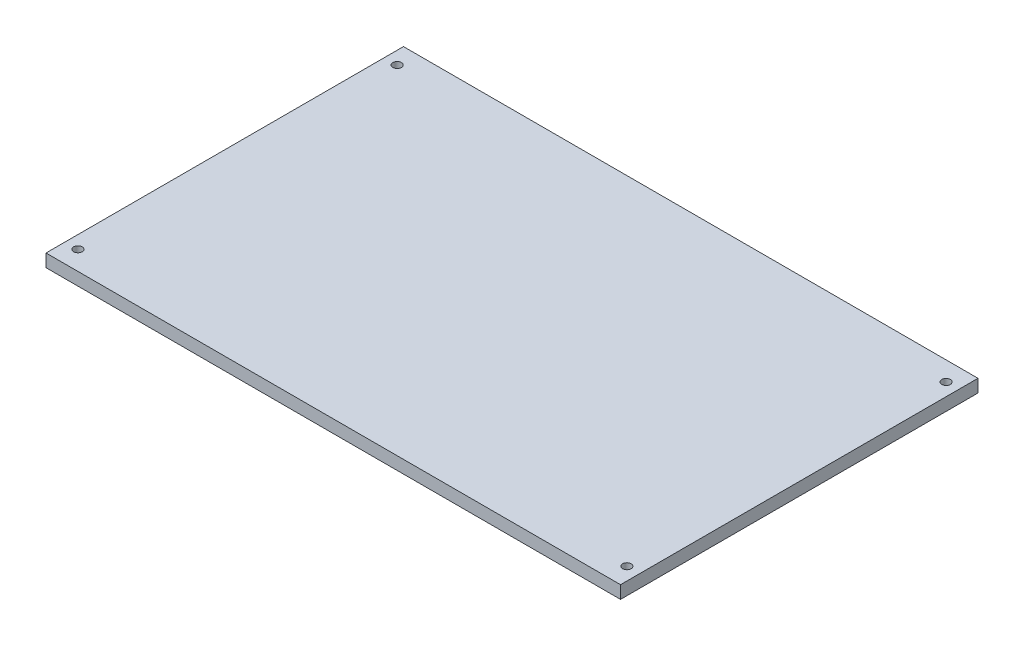
ISO-10303-21;
HEADER;
FILE_DESCRIPTION(('STEP AP214'),'2;1');
FILE_NAME('part.step','',(''),(''),'','','');
FILE_SCHEMA(('AUTOMOTIVE_DESIGN { 1 0 10303 214 1 1 1 1 }'));
ENDSEC;
DATA;
#1=APPLICATION_CONTEXT('core data for automotive mechanical design processes');
#2=APPLICATION_PROTOCOL_DEFINITION('international standard','automotive_design',2000,#1);
#3=PRODUCT_CONTEXT('',#1,'mechanical');
#4=PRODUCT('Part','Part','',(#3));
#5=PRODUCT_RELATED_PRODUCT_CATEGORY('part','',(#4));
#6=PRODUCT_DEFINITION_FORMATION('','',#4);
#7=PRODUCT_DEFINITION_CONTEXT('part definition',#1,'design');
#8=PRODUCT_DEFINITION('design','',#6,#7);
#9=PRODUCT_DEFINITION_SHAPE('','',#8);
#10=(LENGTH_UNIT() NAMED_UNIT(*) SI_UNIT(.MILLI.,.METRE.));
#11=(NAMED_UNIT(*) PLANE_ANGLE_UNIT() SI_UNIT($,.RADIAN.));
#12=(NAMED_UNIT(*) SI_UNIT($,.STERADIAN.) SOLID_ANGLE_UNIT());
#13=UNCERTAINTY_MEASURE_WITH_UNIT(LENGTH_MEASURE(1.E-05),#10,'distance_accuracy_value','');
#14=(GEOMETRIC_REPRESENTATION_CONTEXT(3) GLOBAL_UNCERTAINTY_ASSIGNED_CONTEXT((#13)) GLOBAL_UNIT_ASSIGNED_CONTEXT((#10,
#11,#12)) REPRESENTATION_CONTEXT('',''));
#15=CARTESIAN_POINT('',(0.,0.,0.));
#16=DIRECTION('',(0.,0.,1.));
#17=DIRECTION('',(1.,0.,0.));
#18=AXIS2_PLACEMENT_3D('',#15,#16,#17);
#19=CARTESIAN_POINT('',(-20.,20.,52.1122289849125));
#20=DIRECTION('',(1.,0.,0.));
#21=DIRECTION('',(0.,0.,-1.));
#22=AXIS2_PLACEMENT_3D('',#19,#20,#21);
#23=PLANE('',#22);
#24=DIRECTION('',(0.,0.,1.));
#25=VECTOR('',#24,1.);
#26=CARTESIAN_POINT('',(-20.,0.,52.1122289849125));
#27=LINE('',#26,#25);
#28=CARTESIAN_POINT('',(-20.,0.,-507.887771015088));
#29=VERTEX_POINT('',#28);
#30=CARTESIAN_POINT('',(-20.,0.,52.1122289849125));
#31=VERTEX_POINT('',#30);
#32=EDGE_CURVE('E95',#29,#31,#27,.T.);
#33=ORIENTED_EDGE('',*,*,#32,.T.);
#34=DIRECTION('',(0.,-1.,0.));
#35=VECTOR('',#34,1.);
#36=CARTESIAN_POINT('',(-20.,20.,52.1122289849125));
#37=LINE('',#36,#35);
#38=CARTESIAN_POINT('',(-20.,20.,52.1122289849125));
#39=VERTEX_POINT('',#38);
#40=EDGE_CURVE('E11',#39,#31,#37,.T.);
#41=ORIENTED_EDGE('',*,*,#40,.F.);
#42=DIRECTION('',(0.,0.,1.));
#43=VECTOR('',#42,1.);
#44=CARTESIAN_POINT('',(-20.,20.,52.1122289849125));
#45=LINE('',#44,#43);
#46=CARTESIAN_POINT('',(-20.,20.,-507.887771015088));
#47=VERTEX_POINT('',#46);
#48=EDGE_CURVE('E83',#47,#39,#45,.T.);
#49=ORIENTED_EDGE('',*,*,#48,.F.);
#50=DIRECTION('',(0.,-1.,0.));
#51=VECTOR('',#50,1.);
#52=CARTESIAN_POINT('',(-20.,20.,-507.887771015088));
#53=LINE('',#52,#51);
#54=EDGE_CURVE('E91',#47,#29,#53,.T.);
#55=ORIENTED_EDGE('',*,*,#54,.T.);
#56=EDGE_LOOP('',(#33,#41,#49,#55));
#57=FACE_BOUND('',#56,.T.);
#58=ADVANCED_FACE('F32',(#57),#23,.F.);
#59=CARTESIAN_POINT('',(-20.,20.,52.1122289849125));
#60=DIRECTION('',(0.,0.,-1.));
#61=DIRECTION('',(-1.,0.,0.));
#62=AXIS2_PLACEMENT_3D('',#59,#60,#61);
#63=PLANE('',#62);
#64=DIRECTION('',(1.,0.,0.));
#65=VECTOR('',#64,1.);
#66=CARTESIAN_POINT('',(-20.,0.,52.1122289849125));
#67=LINE('',#66,#65);
#68=CARTESIAN_POINT('',(880.,0.,52.1122289849125));
#69=VERTEX_POINT('',#68);
#70=EDGE_CURVE('E87',#31,#69,#67,.T.);
#71=ORIENTED_EDGE('',*,*,#70,.T.);
#72=DIRECTION('',(0.,-1.,0.));
#73=VECTOR('',#72,1.);
#74=CARTESIAN_POINT('',(880.,20.,52.1122289849125));
#75=LINE('',#74,#73);
#76=CARTESIAN_POINT('',(880.,20.,52.1122289849125));
#77=VERTEX_POINT('',#76);
#78=EDGE_CURVE('E40',#77,#69,#75,.T.);
#79=ORIENTED_EDGE('',*,*,#78,.F.);
#80=DIRECTION('',(1.,0.,0.));
#81=VECTOR('',#80,1.);
#82=CARTESIAN_POINT('',(-20.,20.,52.1122289849125));
#83=LINE('',#82,#81);
#84=EDGE_CURVE('E78',#39,#77,#83,.T.);
#85=ORIENTED_EDGE('',*,*,#84,.F.);
#86=ORIENTED_EDGE('',*,*,#40,.T.);
#87=EDGE_LOOP('',(#71,#79,#85,#86));
#88=FACE_BOUND('',#87,.T.);
#89=ADVANCED_FACE('F86',(#88),#63,.F.);
#90=CARTESIAN_POINT('',(880.,20.,52.1122289849125));
#91=DIRECTION('',(-1.,0.,0.));
#92=DIRECTION('',(0.,0.,1.));
#93=AXIS2_PLACEMENT_3D('',#90,#91,#92);
#94=PLANE('',#93);
#95=DIRECTION('',(0.,0.,-1.));
#96=VECTOR('',#95,1.);
#97=CARTESIAN_POINT('',(880.,0.,52.1122289849125));
#98=LINE('',#97,#96);
#99=CARTESIAN_POINT('',(880.,0.,-507.887771015088));
#100=VERTEX_POINT('',#99);
#101=EDGE_CURVE('E65',#69,#100,#98,.T.);
#102=ORIENTED_EDGE('',*,*,#101,.T.);
#103=DIRECTION('',(0.,-1.,0.));
#104=VECTOR('',#103,1.);
#105=CARTESIAN_POINT('',(880.,20.,-507.887771015088));
#106=LINE('',#105,#104);
#107=CARTESIAN_POINT('',(880.,20.,-507.887771015088));
#108=VERTEX_POINT('',#107);
#109=EDGE_CURVE('E88',#108,#100,#106,.T.);
#110=ORIENTED_EDGE('',*,*,#109,.F.);
#111=DIRECTION('',(0.,0.,-1.));
#112=VECTOR('',#111,1.);
#113=CARTESIAN_POINT('',(880.,20.,52.1122289849125));
#114=LINE('',#113,#112);
#115=EDGE_CURVE('E81',#77,#108,#114,.T.);
#116=ORIENTED_EDGE('',*,*,#115,.F.);
#117=ORIENTED_EDGE('',*,*,#78,.T.);
#118=EDGE_LOOP('',(#102,#110,#116,#117));
#119=FACE_BOUND('',#118,.T.);
#120=ADVANCED_FACE('F89',(#119),#94,.F.);
#121=CARTESIAN_POINT('',(-20.,20.,-507.887771015088));
#122=DIRECTION('',(0.,0.,1.));
#123=DIRECTION('',(1.,0.,0.));
#124=AXIS2_PLACEMENT_3D('',#121,#122,#123);
#125=PLANE('',#124);
#126=DIRECTION('',(-1.,0.,0.));
#127=VECTOR('',#126,1.);
#128=CARTESIAN_POINT('',(-20.,0.,-507.887771015088));
#129=LINE('',#128,#127);
#130=EDGE_CURVE('E71',#100,#29,#129,.T.);
#131=ORIENTED_EDGE('',*,*,#130,.T.);
#132=ORIENTED_EDGE('',*,*,#54,.F.);
#133=DIRECTION('',(-1.,0.,0.));
#134=VECTOR('',#133,1.);
#135=CARTESIAN_POINT('',(-20.,20.,-507.887771015088));
#136=LINE('',#135,#134);
#137=EDGE_CURVE('E48',#108,#47,#136,.T.);
#138=ORIENTED_EDGE('',*,*,#137,.F.);
#139=ORIENTED_EDGE('',*,*,#109,.T.);
#140=EDGE_LOOP('',(#131,#132,#138,#139));
#141=FACE_BOUND('',#140,.T.);
#142=ADVANCED_FACE('F103',(#141),#125,.F.);
#143=CARTESIAN_POINT('',(0.,20.,0.));
#144=DIRECTION('',(0.,-1.,0.));
#145=DIRECTION('',(0.,0.,-1.));
#146=AXIS2_PLACEMENT_3D('',#143,#144,#145);
#147=PLANE('',#146);
#148=CARTESIAN_POINT('',(1.11022302462516E-13,20.,-477.887771015087));
#149=DIRECTION('',(0.,-1.,0.));
#150=DIRECTION('',(0.,0.,-1.));
#151=AXIS2_PLACEMENT_3D('',#148,#149,#150);
#152=CIRCLE('',#151,6.74624);
#153=CARTESIAN_POINT('',(1.11022302462516E-13,20.,-484.634011015088));
#154=VERTEX_POINT('',#153);
#155=EDGE_CURVE('E153',#154,#154,#152,.T.);
#156=ORIENTED_EDGE('',*,*,#155,.T.);
#157=EDGE_LOOP('',(#156));
#158=FACE_BOUND('',#157,.T.);
#159=CARTESIAN_POINT('',(860.,20.,-477.887771015087));
#160=DIRECTION('',(0.,-1.,0.));
#161=DIRECTION('',(0.,0.,-1.));
#162=AXIS2_PLACEMENT_3D('',#159,#160,#161);
#163=CIRCLE('',#162,6.74624000000001);
#164=CARTESIAN_POINT('',(860.,20.,-484.634011015088));
#165=VERTEX_POINT('',#164);
#166=EDGE_CURVE('E138',#165,#165,#163,.T.);
#167=ORIENTED_EDGE('',*,*,#166,.T.);
#168=EDGE_LOOP('',(#167));
#169=FACE_BOUND('',#168,.T.);
#170=CARTESIAN_POINT('',(860.,20.,22.1122289849125));
#171=DIRECTION('',(0.,-1.,0.));
#172=DIRECTION('',(0.,0.,-1.));
#173=AXIS2_PLACEMENT_3D('',#170,#171,#172);
#174=CIRCLE('',#173,6.74624000000001);
#175=CARTESIAN_POINT('',(860.,20.,15.3659889849125));
#176=VERTEX_POINT('',#175);
#177=EDGE_CURVE('E123',#176,#176,#174,.T.);
#178=ORIENTED_EDGE('',*,*,#177,.T.);
#179=EDGE_LOOP('',(#178));
#180=FACE_BOUND('',#179,.T.);
#181=CARTESIAN_POINT('',(0.,20.,22.1122289849126));
#182=DIRECTION('',(0.,-1.,0.));
#183=DIRECTION('',(0.,0.,-1.));
#184=AXIS2_PLACEMENT_3D('',#181,#182,#183);
#185=CIRCLE('',#184,6.74624);
#186=CARTESIAN_POINT('',(0.,20.,15.3659889849126));
#187=VERTEX_POINT('',#186);
#188=EDGE_CURVE('E98',#187,#187,#185,.T.);
#189=ORIENTED_EDGE('',*,*,#188,.T.);
#190=EDGE_LOOP('',(#189));
#191=FACE_BOUND('',#190,.T.);
#192=ORIENTED_EDGE('',*,*,#48,.T.);
#193=ORIENTED_EDGE('',*,*,#84,.T.);
#194=ORIENTED_EDGE('',*,*,#115,.T.);
#195=ORIENTED_EDGE('',*,*,#137,.T.);
#196=EDGE_LOOP('',(#192,#193,#194,#195));
#197=FACE_BOUND('',#196,.T.);
#198=ADVANCED_FACE('F79',(#158,#169,#180,#191,#197),#147,.F.);
#199=CARTESIAN_POINT('',(0.,0.,0.));
#200=DIRECTION('',(0.,-1.,0.));
#201=DIRECTION('',(0.,0.,-1.));
#202=AXIS2_PLACEMENT_3D('',#199,#200,#201);
#203=PLANE('',#202);
#204=CARTESIAN_POINT('',(1.11022302462516E-13,0.,-477.887771015087));
#205=DIRECTION('',(0.,-1.,0.));
#206=DIRECTION('',(0.,0.,-1.));
#207=AXIS2_PLACEMENT_3D('',#204,#205,#206);
#208=CIRCLE('',#207,14.9225);
#209=CARTESIAN_POINT('',(1.11022302462516E-13,0.,-492.810271015087));
#210=VERTEX_POINT('',#209);
#211=EDGE_CURVE('E165',#210,#210,#208,.T.);
#212=ORIENTED_EDGE('',*,*,#211,.F.);
#213=EDGE_LOOP('',(#212));
#214=FACE_BOUND('',#213,.T.);
#215=CARTESIAN_POINT('',(860.,0.,-477.887771015087));
#216=DIRECTION('',(0.,-1.,0.));
#217=DIRECTION('',(0.,0.,-1.));
#218=AXIS2_PLACEMENT_3D('',#215,#216,#217);
#219=CIRCLE('',#218,14.9224999999999);
#220=CARTESIAN_POINT('',(860.,0.,-492.810271015087));
#221=VERTEX_POINT('',#220);
#222=EDGE_CURVE('E150',#221,#221,#219,.T.);
#223=ORIENTED_EDGE('',*,*,#222,.F.);
#224=EDGE_LOOP('',(#223));
#225=FACE_BOUND('',#224,.T.);
#226=CARTESIAN_POINT('',(860.,0.,22.1122289849125));
#227=DIRECTION('',(0.,-1.,0.));
#228=DIRECTION('',(0.,0.,-1.));
#229=AXIS2_PLACEMENT_3D('',#226,#227,#228);
#230=CIRCLE('',#229,14.9224999999999);
#231=CARTESIAN_POINT('',(860.,0.,7.1897289849126));
#232=VERTEX_POINT('',#231);
#233=EDGE_CURVE('E135',#232,#232,#230,.T.);
#234=ORIENTED_EDGE('',*,*,#233,.F.);
#235=EDGE_LOOP('',(#234));
#236=FACE_BOUND('',#235,.T.);
#237=CARTESIAN_POINT('',(0.,0.,22.1122289849126));
#238=DIRECTION('',(0.,-1.,0.));
#239=DIRECTION('',(0.,0.,-1.));
#240=AXIS2_PLACEMENT_3D('',#237,#238,#239);
#241=CIRCLE('',#240,14.9225);
#242=CARTESIAN_POINT('',(0.,0.,7.18972898491256));
#243=VERTEX_POINT('',#242);
#244=EDGE_CURVE('E120',#243,#243,#241,.T.);
#245=ORIENTED_EDGE('',*,*,#244,.F.);
#246=EDGE_LOOP('',(#245));
#247=FACE_BOUND('',#246,.T.);
#248=ORIENTED_EDGE('',*,*,#32,.F.);
#249=ORIENTED_EDGE('',*,*,#130,.F.);
#250=ORIENTED_EDGE('',*,*,#101,.F.);
#251=ORIENTED_EDGE('',*,*,#70,.F.);
#252=EDGE_LOOP('',(#248,#249,#250,#251));
#253=FACE_BOUND('',#252,.T.);
#254=ADVANCED_FACE('F106',(#214,#225,#236,#247,#253),#203,.T.);
#255=CARTESIAN_POINT('',(0.,0.,22.1122289849126));
#256=DIRECTION('',(0.,-1.,0.));
#257=DIRECTION('',(0.,0.,-1.));
#258=AXIS2_PLACEMENT_3D('',#255,#256,#257);
#259=CYLINDRICAL_SURFACE('',#258,6.74624);
#260=ORIENTED_EDGE('',*,*,#188,.F.);
#261=EDGE_LOOP('',(#260));
#262=FACE_BOUND('',#261,.T.);
#263=CARTESIAN_POINT('',(0.,9.2456,22.1122289849126));
#264=DIRECTION('',(0.,-1.,0.));
#265=DIRECTION('',(0.,0.,-1.));
#266=AXIS2_PLACEMENT_3D('',#263,#264,#265);
#267=CIRCLE('',#266,6.74624);
#268=CARTESIAN_POINT('',(0.,9.2456,15.3659889849126));
#269=VERTEX_POINT('',#268);
#270=EDGE_CURVE('E111',#269,#269,#267,.T.);
#271=ORIENTED_EDGE('',*,*,#270,.T.);
#272=EDGE_LOOP('',(#271));
#273=FACE_BOUND('',#272,.T.);
#274=ADVANCED_FACE('F173',(#262,#273),#259,.F.);
#275=CARTESIAN_POINT('',(14.2875,9.2456,22.1122289849126));
#276=DIRECTION('',(0.,1.,0.));
#277=DIRECTION('',(0.,0.,1.));
#278=AXIS2_PLACEMENT_3D('',#275,#276,#277);
#279=PLANE('',#278);
#280=ORIENTED_EDGE('',*,*,#270,.F.);
#281=EDGE_LOOP('',(#280));
#282=FACE_BOUND('',#281,.T.);
#283=CARTESIAN_POINT('',(0.,9.2456,22.1122289849126));
#284=DIRECTION('',(0.,-1.,0.));
#285=DIRECTION('',(0.,0.,-1.));
#286=AXIS2_PLACEMENT_3D('',#283,#284,#285);
#287=CIRCLE('',#286,14.2875);
#288=CARTESIAN_POINT('',(0.,9.2456,7.82472898491256));
#289=VERTEX_POINT('',#288);
#290=EDGE_CURVE('E114',#289,#289,#287,.T.);
#291=ORIENTED_EDGE('',*,*,#290,.T.);
#292=EDGE_LOOP('',(#291));
#293=FACE_BOUND('',#292,.T.);
#294=ADVANCED_FACE('F194',(#282,#293),#279,.F.);
#295=CARTESIAN_POINT('',(0.,0.,22.1122289849126));
#296=DIRECTION('',(0.,-1.,0.));
#297=DIRECTION('',(0.,0.,-1.));
#298=AXIS2_PLACEMENT_3D('',#295,#296,#297);
#299=CYLINDRICAL_SURFACE('',#298,14.2875);
#300=ORIENTED_EDGE('',*,*,#290,.F.);
#301=EDGE_LOOP('',(#300));
#302=FACE_BOUND('',#301,.T.);
#303=CARTESIAN_POINT('',(0.,0.635000000000004,22.1122289849126));
#304=DIRECTION('',(0.,-1.,0.));
#305=DIRECTION('',(0.,0.,-1.));
#306=AXIS2_PLACEMENT_3D('',#303,#304,#305);
#307=CIRCLE('',#306,14.2875);
#308=CARTESIAN_POINT('',(0.,0.635000000000004,7.82472898491256));
#309=VERTEX_POINT('',#308);
#310=EDGE_CURVE('E117',#309,#309,#307,.T.);
#311=ORIENTED_EDGE('',*,*,#310,.T.);
#312=EDGE_LOOP('',(#311));
#313=FACE_BOUND('',#312,.T.);
#314=ADVANCED_FACE('F184',(#302,#313),#299,.F.);
#315=CARTESIAN_POINT('',(0.,0.,22.1122289849126));
#316=DIRECTION('',(0.,-1.,0.));
#317=DIRECTION('',(0.,0.,-1.));
#318=AXIS2_PLACEMENT_3D('',#315,#316,#317);
#319=CONICAL_SURFACE('',#318,14.9225,0.785398163397452);
#320=ORIENTED_EDGE('',*,*,#310,.F.);
#321=EDGE_LOOP('',(#320));
#322=FACE_BOUND('',#321,.T.);
#323=ORIENTED_EDGE('',*,*,#244,.T.);
#324=EDGE_LOOP('',(#323));
#325=FACE_BOUND('',#324,.T.);
#326=ADVANCED_FACE('F181',(#322,#325),#319,.F.);
#327=CARTESIAN_POINT('',(860.,0.,22.1122289849125));
#328=DIRECTION('',(0.,-1.,0.));
#329=DIRECTION('',(0.,0.,-1.));
#330=AXIS2_PLACEMENT_3D('',#327,#328,#329);
#331=CYLINDRICAL_SURFACE('',#330,6.74624000000001);
#332=ORIENTED_EDGE('',*,*,#177,.F.);
#333=EDGE_LOOP('',(#332));
#334=FACE_BOUND('',#333,.T.);
#335=CARTESIAN_POINT('',(860.,9.2456,22.1122289849125));
#336=DIRECTION('',(0.,-1.,0.));
#337=DIRECTION('',(0.,0.,-1.));
#338=AXIS2_PLACEMENT_3D('',#335,#336,#337);
#339=CIRCLE('',#338,6.74624000000001);
#340=CARTESIAN_POINT('',(860.,9.2456,15.3659889849125));
#341=VERTEX_POINT('',#340);
#342=EDGE_CURVE('E126',#341,#341,#339,.T.);
#343=ORIENTED_EDGE('',*,*,#342,.T.);
#344=EDGE_LOOP('',(#343));
#345=FACE_BOUND('',#344,.T.);
#346=ADVANCED_FACE('F183',(#334,#345),#331,.F.);
#347=CARTESIAN_POINT('',(874.2875,9.2456,22.1122289849125));
#348=DIRECTION('',(0.,1.,0.));
#349=DIRECTION('',(0.,0.,1.));
#350=AXIS2_PLACEMENT_3D('',#347,#348,#349);
#351=PLANE('',#350);
#352=ORIENTED_EDGE('',*,*,#342,.F.);
#353=EDGE_LOOP('',(#352));
#354=FACE_BOUND('',#353,.T.);
#355=CARTESIAN_POINT('',(860.,9.2456,22.1122289849125));
#356=DIRECTION('',(0.,-1.,0.));
#357=DIRECTION('',(0.,0.,-1.));
#358=AXIS2_PLACEMENT_3D('',#355,#356,#357);
#359=CIRCLE('',#358,14.2875);
#360=CARTESIAN_POINT('',(860.,9.2456,7.82472898491254));
#361=VERTEX_POINT('',#360);
#362=EDGE_CURVE('E129',#361,#361,#359,.T.);
#363=ORIENTED_EDGE('',*,*,#362,.T.);
#364=EDGE_LOOP('',(#363));
#365=FACE_BOUND('',#364,.T.);
#366=ADVANCED_FACE('F191',(#354,#365),#351,.F.);
#367=CARTESIAN_POINT('',(860.,0.,22.1122289849125));
#368=DIRECTION('',(0.,-1.,0.));
#369=DIRECTION('',(0.,0.,-1.));
#370=AXIS2_PLACEMENT_3D('',#367,#368,#369);
#371=CYLINDRICAL_SURFACE('',#370,14.2875);
#372=ORIENTED_EDGE('',*,*,#362,.F.);
#373=EDGE_LOOP('',(#372));
#374=FACE_BOUND('',#373,.T.);
#375=CARTESIAN_POINT('',(860.,0.635000000000004,22.1122289849125));
#376=DIRECTION('',(0.,-1.,0.));
#377=DIRECTION('',(0.,0.,-1.));
#378=AXIS2_PLACEMENT_3D('',#375,#376,#377);
#379=CIRCLE('',#378,14.2875);
#380=CARTESIAN_POINT('',(860.,0.635000000000004,7.82472898491254));
#381=VERTEX_POINT('',#380);
#382=EDGE_CURVE('E132',#381,#381,#379,.T.);
#383=ORIENTED_EDGE('',*,*,#382,.T.);
#384=EDGE_LOOP('',(#383));
#385=FACE_BOUND('',#384,.T.);
#386=ADVANCED_FACE('F249',(#374,#385),#371,.F.);
#387=CARTESIAN_POINT('',(860.,0.,22.1122289849125));
#388=DIRECTION('',(0.,-1.,0.));
#389=DIRECTION('',(0.,0.,-1.));
#390=AXIS2_PLACEMENT_3D('',#387,#388,#389);
#391=CONICAL_SURFACE('',#390,14.9224999999999,0.7853981633974);
#392=ORIENTED_EDGE('',*,*,#382,.F.);
#393=EDGE_LOOP('',(#392));
#394=FACE_BOUND('',#393,.T.);
#395=ORIENTED_EDGE('',*,*,#233,.T.);
#396=EDGE_LOOP('',(#395));
#397=FACE_BOUND('',#396,.T.);
#398=ADVANCED_FACE('F259',(#394,#397),#391,.F.);
#399=CARTESIAN_POINT('',(860.,0.,-477.887771015087));
#400=DIRECTION('',(0.,-1.,0.));
#401=DIRECTION('',(0.,0.,-1.));
#402=AXIS2_PLACEMENT_3D('',#399,#400,#401);
#403=CYLINDRICAL_SURFACE('',#402,6.74624000000001);
#404=ORIENTED_EDGE('',*,*,#166,.F.);
#405=EDGE_LOOP('',(#404));
#406=FACE_BOUND('',#405,.T.);
#407=CARTESIAN_POINT('',(860.,9.2456,-477.887771015087));
#408=DIRECTION('',(0.,-1.,0.));
#409=DIRECTION('',(0.,0.,-1.));
#410=AXIS2_PLACEMENT_3D('',#407,#408,#409);
#411=CIRCLE('',#410,6.74624000000001);
#412=CARTESIAN_POINT('',(860.,9.2456,-484.634011015088));
#413=VERTEX_POINT('',#412);
#414=EDGE_CURVE('E141',#413,#413,#411,.T.);
#415=ORIENTED_EDGE('',*,*,#414,.T.);
#416=EDGE_LOOP('',(#415));
#417=FACE_BOUND('',#416,.T.);
#418=ADVANCED_FACE('F269',(#406,#417),#403,.F.);
#419=CARTESIAN_POINT('',(874.2875,9.2456,-477.887771015087));
#420=DIRECTION('',(0.,1.,0.));
#421=DIRECTION('',(0.,0.,1.));
#422=AXIS2_PLACEMENT_3D('',#419,#420,#421);
#423=PLANE('',#422);
#424=ORIENTED_EDGE('',*,*,#414,.F.);
#425=EDGE_LOOP('',(#424));
#426=FACE_BOUND('',#425,.T.);
#427=CARTESIAN_POINT('',(860.,9.2456,-477.887771015087));
#428=DIRECTION('',(0.,-1.,0.));
#429=DIRECTION('',(0.,0.,-1.));
#430=AXIS2_PLACEMENT_3D('',#427,#428,#429);
#431=CIRCLE('',#430,14.2875);
#432=CARTESIAN_POINT('',(860.,9.2456,-492.175271015088));
#433=VERTEX_POINT('',#432);
#434=EDGE_CURVE('E144',#433,#433,#431,.T.);
#435=ORIENTED_EDGE('',*,*,#434,.T.);
#436=EDGE_LOOP('',(#435));
#437=FACE_BOUND('',#436,.T.);
#438=ADVANCED_FACE('F279',(#426,#437),#423,.F.);
#439=CARTESIAN_POINT('',(860.,0.,-477.887771015087));
#440=DIRECTION('',(0.,-1.,0.));
#441=DIRECTION('',(0.,0.,-1.));
#442=AXIS2_PLACEMENT_3D('',#439,#440,#441);
#443=CYLINDRICAL_SURFACE('',#442,14.2875);
#444=ORIENTED_EDGE('',*,*,#434,.F.);
#445=EDGE_LOOP('',(#444));
#446=FACE_BOUND('',#445,.T.);
#447=CARTESIAN_POINT('',(860.,0.635000000000004,-477.887771015087));
#448=DIRECTION('',(0.,-1.,0.));
#449=DIRECTION('',(0.,0.,-1.));
#450=AXIS2_PLACEMENT_3D('',#447,#448,#449);
#451=CIRCLE('',#450,14.2875);
#452=CARTESIAN_POINT('',(860.,0.635000000000004,-492.175271015088));
#453=VERTEX_POINT('',#452);
#454=EDGE_CURVE('E147',#453,#453,#451,.T.);
#455=ORIENTED_EDGE('',*,*,#454,.T.);
#456=EDGE_LOOP('',(#455));
#457=FACE_BOUND('',#456,.T.);
#458=ADVANCED_FACE('F289',(#446,#457),#443,.F.);
#459=CARTESIAN_POINT('',(860.,0.,-477.887771015087));
#460=DIRECTION('',(0.,-1.,0.));
#461=DIRECTION('',(0.,0.,-1.));
#462=AXIS2_PLACEMENT_3D('',#459,#460,#461);
#463=CONICAL_SURFACE('',#462,14.9224999999999,0.7853981633974);
#464=ORIENTED_EDGE('',*,*,#454,.F.);
#465=EDGE_LOOP('',(#464));
#466=FACE_BOUND('',#465,.T.);
#467=ORIENTED_EDGE('',*,*,#222,.T.);
#468=EDGE_LOOP('',(#467));
#469=FACE_BOUND('',#468,.T.);
#470=ADVANCED_FACE('F299',(#466,#469),#463,.F.);
#471=CARTESIAN_POINT('',(1.11022302462516E-13,0.,-477.887771015087));
#472=DIRECTION('',(0.,-1.,0.));
#473=DIRECTION('',(0.,0.,-1.));
#474=AXIS2_PLACEMENT_3D('',#471,#472,#473);
#475=CYLINDRICAL_SURFACE('',#474,6.74624);
#476=ORIENTED_EDGE('',*,*,#155,.F.);
#477=EDGE_LOOP('',(#476));
#478=FACE_BOUND('',#477,.T.);
#479=CARTESIAN_POINT('',(1.11022302462516E-13,9.2456,-477.887771015087));
#480=DIRECTION('',(0.,-1.,0.));
#481=DIRECTION('',(0.,0.,-1.));
#482=AXIS2_PLACEMENT_3D('',#479,#480,#481);
#483=CIRCLE('',#482,6.74624);
#484=CARTESIAN_POINT('',(1.11022302462516E-13,9.2456,-484.634011015088));
#485=VERTEX_POINT('',#484);
#486=EDGE_CURVE('E156',#485,#485,#483,.T.);
#487=ORIENTED_EDGE('',*,*,#486,.T.);
#488=EDGE_LOOP('',(#487));
#489=FACE_BOUND('',#488,.T.);
#490=ADVANCED_FACE('F309',(#478,#489),#475,.F.);
#491=CARTESIAN_POINT('',(14.2875000000001,9.2456,-477.887771015087));
#492=DIRECTION('',(0.,1.,0.));
#493=DIRECTION('',(0.,0.,1.));
#494=AXIS2_PLACEMENT_3D('',#491,#492,#493);
#495=PLANE('',#494);
#496=ORIENTED_EDGE('',*,*,#486,.F.);
#497=EDGE_LOOP('',(#496));
#498=FACE_BOUND('',#497,.T.);
#499=CARTESIAN_POINT('',(1.11022302462516E-13,9.2456,-477.887771015087));
#500=DIRECTION('',(0.,-1.,0.));
#501=DIRECTION('',(0.,0.,-1.));
#502=AXIS2_PLACEMENT_3D('',#499,#500,#501);
#503=CIRCLE('',#502,14.2875);
#504=CARTESIAN_POINT('',(1.11022302462516E-13,9.2456,-492.175271015088));
#505=VERTEX_POINT('',#504);
#506=EDGE_CURVE('E159',#505,#505,#503,.T.);
#507=ORIENTED_EDGE('',*,*,#506,.T.);
#508=EDGE_LOOP('',(#507));
#509=FACE_BOUND('',#508,.T.);
#510=ADVANCED_FACE('F319',(#498,#509),#495,.F.);
#511=CARTESIAN_POINT('',(1.11022302462516E-13,0.,-477.887771015087));
#512=DIRECTION('',(0.,-1.,0.));
#513=DIRECTION('',(0.,0.,-1.));
#514=AXIS2_PLACEMENT_3D('',#511,#512,#513);
#515=CYLINDRICAL_SURFACE('',#514,14.2875);
#516=ORIENTED_EDGE('',*,*,#506,.F.);
#517=EDGE_LOOP('',(#516));
#518=FACE_BOUND('',#517,.T.);
#519=CARTESIAN_POINT('',(1.11022302462516E-13,0.635000000000004,-477.887771015087));
#520=DIRECTION('',(0.,-1.,0.));
#521=DIRECTION('',(0.,0.,-1.));
#522=AXIS2_PLACEMENT_3D('',#519,#520,#521);
#523=CIRCLE('',#522,14.2875);
#524=CARTESIAN_POINT('',(1.11022302462516E-13,0.635000000000004,-492.175271015088));
#525=VERTEX_POINT('',#524);
#526=EDGE_CURVE('E162',#525,#525,#523,.T.);
#527=ORIENTED_EDGE('',*,*,#526,.T.);
#528=EDGE_LOOP('',(#527));
#529=FACE_BOUND('',#528,.T.);
#530=ADVANCED_FACE('F329',(#518,#529),#515,.F.);
#531=CARTESIAN_POINT('',(1.11022302462516E-13,0.,-477.887771015087));
#532=DIRECTION('',(0.,-1.,0.));
#533=DIRECTION('',(0.,0.,-1.));
#534=AXIS2_PLACEMENT_3D('',#531,#532,#533);
#535=CONICAL_SURFACE('',#534,14.9225,0.785398163397452);
#536=ORIENTED_EDGE('',*,*,#526,.F.);
#537=EDGE_LOOP('',(#536));
#538=FACE_BOUND('',#537,.T.);
#539=ORIENTED_EDGE('',*,*,#211,.T.);
#540=EDGE_LOOP('',(#539));
#541=FACE_BOUND('',#540,.T.);
#542=ADVANCED_FACE('F169',(#538,#541),#535,.F.);
#543=CLOSED_SHELL('',(#58,#89,#120,#142,#198,#254,#274,#294,#314,#326,#346,#366,#386,#398,#418,
#438,#458,#470,#490,#510,#530,#542));
#544=MANIFOLD_SOLID_BREP('B2',#543);
#545=ADVANCED_BREP_SHAPE_REPRESENTATION('',(#18,#544),#14);
#546=SHAPE_DEFINITION_REPRESENTATION(#9,#545);
ENDSEC;
END-ISO-10303-21;
